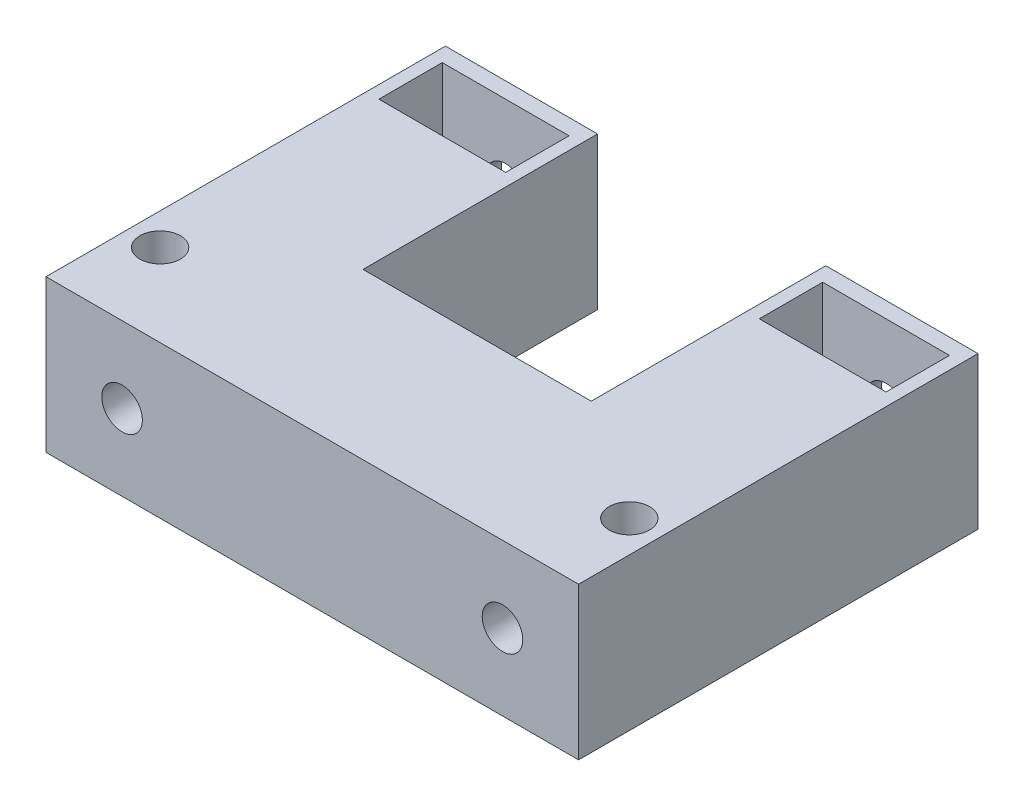
ISO-10303-21;
HEADER;
FILE_DESCRIPTION(('STEP AP214'),'2;1');
FILE_NAME('part.step','',(''),(''),'','','');
FILE_SCHEMA(('AUTOMOTIVE_DESIGN { 1 0 10303 214 1 1 1 1 }'));
ENDSEC;
DATA;
#1=APPLICATION_CONTEXT('core data for automotive mechanical design processes');
#2=APPLICATION_PROTOCOL_DEFINITION('international standard','automotive_design',2000,#1);
#3=PRODUCT_CONTEXT('',#1,'mechanical');
#4=PRODUCT('Part','Part','',(#3));
#5=PRODUCT_RELATED_PRODUCT_CATEGORY('part','',(#4));
#6=PRODUCT_DEFINITION_FORMATION('','',#4);
#7=PRODUCT_DEFINITION_CONTEXT('part definition',#1,'design');
#8=PRODUCT_DEFINITION('design','',#6,#7);
#9=PRODUCT_DEFINITION_SHAPE('','',#8);
#10=(LENGTH_UNIT() NAMED_UNIT(*) SI_UNIT(.MILLI.,.METRE.));
#11=(NAMED_UNIT(*) PLANE_ANGLE_UNIT() SI_UNIT($,.RADIAN.));
#12=(NAMED_UNIT(*) SI_UNIT($,.STERADIAN.) SOLID_ANGLE_UNIT());
#13=UNCERTAINTY_MEASURE_WITH_UNIT(LENGTH_MEASURE(1.E-05),#10,'distance_accuracy_value','');
#14=(GEOMETRIC_REPRESENTATION_CONTEXT(3) GLOBAL_UNCERTAINTY_ASSIGNED_CONTEXT((#13)) GLOBAL_UNIT_ASSIGNED_CONTEXT((#10,
#11,#12)) REPRESENTATION_CONTEXT('',''));
#15=CARTESIAN_POINT('',(0.,0.,0.));
#16=DIRECTION('',(0.,0.,1.));
#17=DIRECTION('',(1.,0.,0.));
#18=AXIS2_PLACEMENT_3D('',#15,#16,#17);
#19=CARTESIAN_POINT('',(36.,6.,17.25));
#20=DIRECTION('',(0.,0.,1.));
#21=DIRECTION('',(1.,0.,0.));
#22=AXIS2_PLACEMENT_3D('',#19,#20,#21);
#23=PLANE('',#22);
#24=DIRECTION('',(0.,1.,0.));
#25=VECTOR('',#24,1.);
#26=CARTESIAN_POINT('',(24.,6.,17.25));
#27=LINE('',#26,#25);
#28=CARTESIAN_POINT('',(24.,-6.,17.25));
#29=VERTEX_POINT('',#28);
#30=CARTESIAN_POINT('',(24.,6.,17.25));
#31=VERTEX_POINT('',#30);
#32=EDGE_CURVE('E199',#29,#31,#27,.T.);
#33=ORIENTED_EDGE('',*,*,#32,.F.);
#34=DIRECTION('',(-1.,0.,0.));
#35=VECTOR('',#34,1.);
#36=CARTESIAN_POINT('',(36.,-6.,17.25));
#37=LINE('',#36,#35);
#38=CARTESIAN_POINT('',(6.,-6.,17.25));
#39=VERTEX_POINT('',#38);
#40=EDGE_CURVE('E244',#29,#39,#37,.T.);
#41=ORIENTED_EDGE('',*,*,#40,.T.);
#42=DIRECTION('',(0.,1.,0.));
#43=VECTOR('',#42,1.);
#44=CARTESIAN_POINT('',(6.,6.,17.25));
#45=LINE('',#44,#43);
#46=CARTESIAN_POINT('',(6.,6.,17.25));
#47=VERTEX_POINT('',#46);
#48=EDGE_CURVE('E219',#39,#47,#45,.T.);
#49=ORIENTED_EDGE('',*,*,#48,.T.);
#50=DIRECTION('',(-1.,0.,0.));
#51=VECTOR('',#50,1.);
#52=CARTESIAN_POINT('',(36.,6.,17.25));
#53=LINE('',#52,#51);
#54=EDGE_CURVE('E228',#31,#47,#53,.T.);
#55=ORIENTED_EDGE('',*,*,#54,.F.);
#56=EDGE_LOOP('',(#33,#41,#49,#55));
#57=FACE_BOUND('',#56,.T.);
#58=ADVANCED_FACE('F48',(#57),#23,.F.);
#59=CARTESIAN_POINT('',(6.,-6.,-1.25));
#60=DIRECTION('',(-1.,0.,0.));
#61=DIRECTION('',(0.,0.,1.));
#62=AXIS2_PLACEMENT_3D('',#59,#60,#61);
#63=PLANE('',#62);
#64=ORIENTED_EDGE('',*,*,#48,.F.);
#65=DIRECTION('',(0.,0.,1.));
#66=VECTOR('',#65,1.);
#67=CARTESIAN_POINT('',(6.,-6.,-1.25));
#68=LINE('',#67,#66);
#69=CARTESIAN_POINT('',(6.,-6.,-1.25));
#70=VERTEX_POINT('',#69);
#71=EDGE_CURVE('E237',#70,#39,#68,.T.);
#72=ORIENTED_EDGE('',*,*,#71,.F.);
#73=DIRECTION('',(0.,-1.,0.));
#74=VECTOR('',#73,1.);
#75=CARTESIAN_POINT('',(6.,-6.,-1.25));
#76=LINE('',#75,#74);
#77=CARTESIAN_POINT('',(6.,6.,-1.25));
#78=VERTEX_POINT('',#77);
#79=EDGE_CURVE('E287',#78,#70,#76,.T.);
#80=ORIENTED_EDGE('',*,*,#79,.F.);
#81=DIRECTION('',(0.,0.,1.));
#82=VECTOR('',#81,1.);
#83=CARTESIAN_POINT('',(6.,6.,-1.25));
#84=LINE('',#83,#82);
#85=EDGE_CURVE('E299',#78,#47,#84,.T.);
#86=ORIENTED_EDGE('',*,*,#85,.T.);
#87=EDGE_LOOP('',(#64,#72,#80,#86));
#88=FACE_BOUND('',#87,.T.);
#89=ADVANCED_FACE('F345',(#88),#63,.F.);
#90=CARTESIAN_POINT('',(-5.,0.,5.));
#91=DIRECTION('',(-1.,0.,0.));
#92=DIRECTION('',(0.,0.,1.));
#93=AXIS2_PLACEMENT_3D('',#90,#91,#92);
#94=PLANE('',#93);
#95=DIRECTION('',(0.,1.,0.));
#96=VECTOR('',#95,1.);
#97=CARTESIAN_POINT('',(-5.,0.,0.));
#98=LINE('',#97,#96);
#99=CARTESIAN_POINT('',(-5.,-6.,0.));
#100=VERTEX_POINT('',#99);
#101=CARTESIAN_POINT('',(-5.,6.,0.));
#102=VERTEX_POINT('',#101);
#103=EDGE_CURVE('E318',#100,#102,#98,.T.);
#104=ORIENTED_EDGE('',*,*,#103,.T.);
#105=DIRECTION('',(0.,0.,-1.));
#106=VECTOR('',#105,1.);
#107=CARTESIAN_POINT('',(-5.,6.,5.));
#108=LINE('',#107,#106);
#109=CARTESIAN_POINT('',(-5.,6.,5.));
#110=VERTEX_POINT('',#109);
#111=EDGE_CURVE('E13',#110,#102,#108,.T.);
#112=ORIENTED_EDGE('',*,*,#111,.F.);
#113=DIRECTION('',(0.,1.,0.));
#114=VECTOR('',#113,1.);
#115=CARTESIAN_POINT('',(-5.,0.,5.));
#116=LINE('',#115,#114);
#117=CARTESIAN_POINT('',(-5.,-6.,5.));
#118=VERTEX_POINT('',#117);
#119=EDGE_CURVE('E314',#118,#110,#116,.T.);
#120=ORIENTED_EDGE('',*,*,#119,.F.);
#121=DIRECTION('',(0.,0.,-1.));
#122=VECTOR('',#121,1.);
#123=CARTESIAN_POINT('',(-5.,-6.,5.));
#124=LINE('',#123,#122);
#125=EDGE_CURVE('E317',#118,#100,#124,.T.);
#126=ORIENTED_EDGE('',*,*,#125,.T.);
#127=EDGE_LOOP('',(#104,#112,#120,#126));
#128=FACE_BOUND('',#127,.T.);
#129=ADVANCED_FACE('F50',(#128),#94,.F.);
#130=CARTESIAN_POINT('',(0.,6.,5.));
#131=DIRECTION('',(0.,-1.,0.));
#132=DIRECTION('',(1.,0.,0.));
#133=AXIS2_PLACEMENT_3D('',#130,#131,#132);
#134=PLANE('',#133);
#135=CARTESIAN_POINT('',(33.5,6.00000000000001,23.75));
#136=DIRECTION('',(0.,1.,0.));
#137=DIRECTION('',(1.,0.,0.));
#138=AXIS2_PLACEMENT_3D('',#135,#136,#137);
#139=CIRCLE('',#138,1.6);
#140=CARTESIAN_POINT('',(35.1,6.00000000000001,23.75));
#141=VERTEX_POINT('',#140);
#142=EDGE_CURVE('E411',#141,#141,#139,.T.);
#143=ORIENTED_EDGE('',*,*,#142,.F.);
#144=EDGE_LOOP('',(#143));
#145=FACE_BOUND('',#144,.T.);
#146=CARTESIAN_POINT('',(-3.5,6.,23.75));
#147=DIRECTION('',(0.,1.,0.));
#148=DIRECTION('',(-1.,0.,0.));
#149=AXIS2_PLACEMENT_3D('',#146,#147,#148);
#150=CIRCLE('',#149,1.6);
#151=CARTESIAN_POINT('',(-5.1,6.,23.75));
#152=VERTEX_POINT('',#151);
#153=EDGE_CURVE('E415',#152,#152,#150,.T.);
#154=ORIENTED_EDGE('',*,*,#153,.F.);
#155=EDGE_LOOP('',(#154));
#156=FACE_BOUND('',#155,.T.);
#157=DIRECTION('',(0.,0.,1.));
#158=VECTOR('',#157,1.);
#159=CARTESIAN_POINT('',(25.,6.,0.));
#160=LINE('',#159,#158);
#161=CARTESIAN_POINT('',(25.,6.,0.));
#162=VERTEX_POINT('',#161);
#163=CARTESIAN_POINT('',(25.,6.,5.));
#164=VERTEX_POINT('',#163);
#165=EDGE_CURVE('E193',#162,#164,#160,.T.);
#166=ORIENTED_EDGE('',*,*,#165,.F.);
#167=DIRECTION('',(-1.,0.,0.));
#168=VECTOR('',#167,1.);
#169=CARTESIAN_POINT('',(35.,6.00000000000001,0.));
#170=LINE('',#169,#168);
#171=CARTESIAN_POINT('',(35.,6.00000000000001,0.));
#172=VERTEX_POINT('',#171);
#173=EDGE_CURVE('E65',#172,#162,#170,.T.);
#174=ORIENTED_EDGE('',*,*,#173,.F.);
#175=DIRECTION('',(0.,0.,-1.));
#176=VECTOR('',#175,1.);
#177=CARTESIAN_POINT('',(35.,6.00000000000001,5.));
#178=LINE('',#177,#176);
#179=CARTESIAN_POINT('',(35.,6.00000000000001,5.));
#180=VERTEX_POINT('',#179);
#181=EDGE_CURVE('E181',#180,#172,#178,.T.);
#182=ORIENTED_EDGE('',*,*,#181,.F.);
#183=DIRECTION('',(1.,0.,0.));
#184=VECTOR('',#183,1.);
#185=CARTESIAN_POINT('',(25.,6.,5.));
#186=LINE('',#185,#184);
#187=EDGE_CURVE('E184',#164,#180,#186,.T.);
#188=ORIENTED_EDGE('',*,*,#187,.F.);
#189=EDGE_LOOP('',(#166,#174,#182,#188));
#190=FACE_BOUND('',#189,.T.);
#191=DIRECTION('',(0.,0.,-1.));
#192=VECTOR('',#191,1.);
#193=CARTESIAN_POINT('',(-6.,6.,5.));
#194=LINE('',#193,#192);
#195=CARTESIAN_POINT('',(-6.,6.,30.25));
#196=VERTEX_POINT('',#195);
#197=CARTESIAN_POINT('',(-6.,6.,-1.25));
#198=VERTEX_POINT('',#197);
#199=EDGE_CURVE('E57',#196,#198,#194,.T.);
#200=ORIENTED_EDGE('',*,*,#199,.F.);
#201=DIRECTION('',(-1.,0.,0.));
#202=VECTOR('',#201,1.);
#203=CARTESIAN_POINT('',(6.,6.,30.25));
#204=LINE('',#203,#202);
#205=CARTESIAN_POINT('',(36.,6.,30.25));
#206=VERTEX_POINT('',#205);
#207=EDGE_CURVE('E258',#206,#196,#204,.T.);
#208=ORIENTED_EDGE('',*,*,#207,.F.);
#209=DIRECTION('',(0.,0.,1.));
#210=VECTOR('',#209,1.);
#211=CARTESIAN_POINT('',(36.,6.,30.25));
#212=LINE('',#211,#210);
#213=CARTESIAN_POINT('',(36.,6.,-1.25));
#214=VERTEX_POINT('',#213);
#215=EDGE_CURVE('E225',#214,#206,#212,.T.);
#216=ORIENTED_EDGE('',*,*,#215,.F.);
#217=DIRECTION('',(1.,0.,0.));
#218=VECTOR('',#217,1.);
#219=CARTESIAN_POINT('',(36.,6.,-1.25));
#220=LINE('',#219,#218);
#221=CARTESIAN_POINT('',(24.,6.,-1.25));
#222=VERTEX_POINT('',#221);
#223=EDGE_CURVE('E210',#222,#214,#220,.T.);
#224=ORIENTED_EDGE('',*,*,#223,.F.);
#225=DIRECTION('',(0.,0.,1.));
#226=VECTOR('',#225,1.);
#227=CARTESIAN_POINT('',(24.,6.,-1.25));
#228=LINE('',#227,#226);
#229=EDGE_CURVE('E213',#222,#31,#228,.T.);
#230=ORIENTED_EDGE('',*,*,#229,.T.);
#231=ORIENTED_EDGE('',*,*,#54,.T.);
#232=ORIENTED_EDGE('',*,*,#85,.F.);
#233=DIRECTION('',(1.,0.,0.));
#234=VECTOR('',#233,1.);
#235=CARTESIAN_POINT('',(-6.,6.,-1.25));
#236=LINE('',#235,#234);
#237=EDGE_CURVE('E297',#198,#78,#236,.T.);
#238=ORIENTED_EDGE('',*,*,#237,.F.);
#239=EDGE_LOOP('',(#200,#208,#216,#224,#230,#231,#232,#238));
#240=FACE_BOUND('',#239,.T.);
#241=ORIENTED_EDGE('',*,*,#111,.T.);
#242=DIRECTION('',(1.,0.,0.));
#243=VECTOR('',#242,1.);
#244=CARTESIAN_POINT('',(-6.,6.,0.));
#245=LINE('',#244,#243);
#246=CARTESIAN_POINT('',(5.,6.,0.));
#247=VERTEX_POINT('',#246);
#248=EDGE_CURVE('E291',#102,#247,#245,.T.);
#249=ORIENTED_EDGE('',*,*,#248,.T.);
#250=DIRECTION('',(0.,0.,-1.));
#251=VECTOR('',#250,1.);
#252=CARTESIAN_POINT('',(5.,6.,5.));
#253=LINE('',#252,#251);
#254=CARTESIAN_POINT('',(5.,6.,5.));
#255=VERTEX_POINT('',#254);
#256=EDGE_CURVE('E280',#255,#247,#253,.T.);
#257=ORIENTED_EDGE('',*,*,#256,.F.);
#258=DIRECTION('',(-1.,0.,0.));
#259=VECTOR('',#258,1.);
#260=CARTESIAN_POINT('',(6.,6.,5.));
#261=LINE('',#260,#259);
#262=EDGE_CURVE('E274',#255,#110,#261,.T.);
#263=ORIENTED_EDGE('',*,*,#262,.T.);
#264=EDGE_LOOP('',(#241,#249,#257,#263));
#265=FACE_BOUND('',#264,.T.);
#266=ADVANCED_FACE('F339',(#145,#156,#190,#240,#265),#134,.F.);
#267=CARTESIAN_POINT('',(-6.,0.,5.));
#268=DIRECTION('',(-1.,0.,0.));
#269=DIRECTION('',(0.,0.,1.));
#270=AXIS2_PLACEMENT_3D('',#267,#268,#269);
#271=PLANE('',#270);
#272=ORIENTED_EDGE('',*,*,#199,.T.);
#273=DIRECTION('',(0.,1.,0.));
#274=VECTOR('',#273,1.);
#275=CARTESIAN_POINT('',(-6.,-6.,-1.25));
#276=LINE('',#275,#274);
#277=CARTESIAN_POINT('',(-6.,-6.,-1.25));
#278=VERTEX_POINT('',#277);
#279=EDGE_CURVE('E294',#278,#198,#276,.T.);
#280=ORIENTED_EDGE('',*,*,#279,.F.);
#281=DIRECTION('',(0.,0.,-1.));
#282=VECTOR('',#281,1.);
#283=CARTESIAN_POINT('',(-6.,-6.,5.));
#284=LINE('',#283,#282);
#285=CARTESIAN_POINT('',(-6.,-6.,30.25));
#286=VERTEX_POINT('',#285);
#287=EDGE_CURVE('E321',#286,#278,#284,.T.);
#288=ORIENTED_EDGE('',*,*,#287,.F.);
#289=DIRECTION('',(0.,-1.,0.));
#290=VECTOR('',#289,1.);
#291=CARTESIAN_POINT('',(-6.,-6.,30.25));
#292=LINE('',#291,#290);
#293=EDGE_CURVE('E250',#196,#286,#292,.T.);
#294=ORIENTED_EDGE('',*,*,#293,.F.);
#295=EDGE_LOOP('',(#272,#280,#288,#294));
#296=FACE_BOUND('',#295,.T.);
#297=ADVANCED_FACE('F333',(#296),#271,.T.);
#298=CARTESIAN_POINT('',(0.,-6.,5.));
#299=DIRECTION('',(0.,-1.,0.));
#300=DIRECTION('',(1.,0.,0.));
#301=AXIS2_PLACEMENT_3D('',#298,#299,#300);
#302=PLANE('',#301);
#303=CARTESIAN_POINT('',(33.5,-5.99999999999999,23.75));
#304=DIRECTION('',(0.,1.,0.));
#305=DIRECTION('',(1.,0.,0.));
#306=AXIS2_PLACEMENT_3D('',#303,#304,#305);
#307=CIRCLE('',#306,1.6);
#308=CARTESIAN_POINT('',(35.1,-5.99999999999999,23.75));
#309=VERTEX_POINT('',#308);
#310=EDGE_CURVE('E614',#309,#309,#307,.T.);
#311=ORIENTED_EDGE('',*,*,#310,.T.);
#312=EDGE_LOOP('',(#311));
#313=FACE_BOUND('',#312,.T.);
#314=CARTESIAN_POINT('',(-3.5,-6.,23.75));
#315=DIRECTION('',(0.,1.,0.));
#316=DIRECTION('',(-1.,0.,0.));
#317=AXIS2_PLACEMENT_3D('',#314,#315,#316);
#318=CIRCLE('',#317,1.6);
#319=CARTESIAN_POINT('',(-5.1,-6.,23.75));
#320=VERTEX_POINT('',#319);
#321=EDGE_CURVE('E618',#320,#320,#318,.T.);
#322=ORIENTED_EDGE('',*,*,#321,.T.);
#323=EDGE_LOOP('',(#322));
#324=FACE_BOUND('',#323,.T.);
#325=DIRECTION('',(-1.,0.,0.));
#326=VECTOR('',#325,1.);
#327=CARTESIAN_POINT('',(35.,-5.99999999999999,0.));
#328=LINE('',#327,#326);
#329=CARTESIAN_POINT('',(35.,-5.99999999999999,0.));
#330=VERTEX_POINT('',#329);
#331=CARTESIAN_POINT('',(25.,-6.,0.));
#332=VERTEX_POINT('',#331);
#333=EDGE_CURVE('E165',#330,#332,#328,.T.);
#334=ORIENTED_EDGE('',*,*,#333,.T.);
#335=DIRECTION('',(0.,0.,1.));
#336=VECTOR('',#335,1.);
#337=CARTESIAN_POINT('',(25.,-6.,0.));
#338=LINE('',#337,#336);
#339=CARTESIAN_POINT('',(25.,-5.99999999999999,5.));
#340=VERTEX_POINT('',#339);
#341=EDGE_CURVE('E174',#332,#340,#338,.T.);
#342=ORIENTED_EDGE('',*,*,#341,.T.);
#343=DIRECTION('',(1.,0.,0.));
#344=VECTOR('',#343,1.);
#345=CARTESIAN_POINT('',(25.,-6.,5.));
#346=LINE('',#345,#344);
#347=CARTESIAN_POINT('',(35.,-5.99999999999999,5.));
#348=VERTEX_POINT('',#347);
#349=EDGE_CURVE('E73',#340,#348,#346,.T.);
#350=ORIENTED_EDGE('',*,*,#349,.T.);
#351=DIRECTION('',(0.,0.,-1.));
#352=VECTOR('',#351,1.);
#353=CARTESIAN_POINT('',(35.,-5.99999999999999,5.));
#354=LINE('',#353,#352);
#355=EDGE_CURVE('E171',#348,#330,#354,.T.);
#356=ORIENTED_EDGE('',*,*,#355,.T.);
#357=EDGE_LOOP('',(#334,#342,#350,#356));
#358=FACE_BOUND('',#357,.T.);
#359=ORIENTED_EDGE('',*,*,#71,.T.);
#360=ORIENTED_EDGE('',*,*,#40,.F.);
#361=DIRECTION('',(0.,0.,1.));
#362=VECTOR('',#361,1.);
#363=CARTESIAN_POINT('',(24.,-6.,-1.25));
#364=LINE('',#363,#362);
#365=CARTESIAN_POINT('',(24.,-6.,-1.25));
#366=VERTEX_POINT('',#365);
#367=EDGE_CURVE('E217',#366,#29,#364,.T.);
#368=ORIENTED_EDGE('',*,*,#367,.F.);
#369=DIRECTION('',(-1.,0.,0.));
#370=VECTOR('',#369,1.);
#371=CARTESIAN_POINT('',(36.,-6.,-1.25));
#372=LINE('',#371,#370);
#373=CARTESIAN_POINT('',(36.,-6.,-1.25));
#374=VERTEX_POINT('',#373);
#375=EDGE_CURVE('E206',#374,#366,#372,.T.);
#376=ORIENTED_EDGE('',*,*,#375,.F.);
#377=DIRECTION('',(0.,0.,-1.));
#378=VECTOR('',#377,1.);
#379=CARTESIAN_POINT('',(36.,-6.,30.25));
#380=LINE('',#379,#378);
#381=CARTESIAN_POINT('',(36.,-6.,30.25));
#382=VERTEX_POINT('',#381);
#383=EDGE_CURVE('E223',#382,#374,#380,.T.);
#384=ORIENTED_EDGE('',*,*,#383,.F.);
#385=DIRECTION('',(1.,0.,0.));
#386=VECTOR('',#385,1.);
#387=CARTESIAN_POINT('',(6.,-6.,30.25));
#388=LINE('',#387,#386);
#389=EDGE_CURVE('E254',#286,#382,#388,.T.);
#390=ORIENTED_EDGE('',*,*,#389,.F.);
#391=ORIENTED_EDGE('',*,*,#287,.T.);
#392=DIRECTION('',(-1.,0.,0.));
#393=VECTOR('',#392,1.);
#394=CARTESIAN_POINT('',(-6.,-6.,-1.25));
#395=LINE('',#394,#393);
#396=EDGE_CURVE('E290',#70,#278,#395,.T.);
#397=ORIENTED_EDGE('',*,*,#396,.F.);
#398=EDGE_LOOP('',(#359,#360,#368,#376,#384,#390,#391,#397));
#399=FACE_BOUND('',#398,.T.);
#400=ORIENTED_EDGE('',*,*,#125,.F.);
#401=DIRECTION('',(1.,0.,0.));
#402=VECTOR('',#401,1.);
#403=CARTESIAN_POINT('',(6.,-6.,5.));
#404=LINE('',#403,#402);
#405=CARTESIAN_POINT('',(5.,-6.,5.));
#406=VERTEX_POINT('',#405);
#407=EDGE_CURVE('E271',#118,#406,#404,.T.);
#408=ORIENTED_EDGE('',*,*,#407,.T.);
#409=DIRECTION('',(0.,0.,-1.));
#410=VECTOR('',#409,1.);
#411=CARTESIAN_POINT('',(5.,-6.,5.));
#412=LINE('',#411,#410);
#413=CARTESIAN_POINT('',(5.,-6.,0.));
#414=VERTEX_POINT('',#413);
#415=EDGE_CURVE('E284',#406,#414,#412,.T.);
#416=ORIENTED_EDGE('',*,*,#415,.T.);
#417=DIRECTION('',(-1.,0.,0.));
#418=VECTOR('',#417,1.);
#419=CARTESIAN_POINT('',(-6.,-6.,0.));
#420=LINE('',#419,#418);
#421=EDGE_CURVE('E286',#414,#100,#420,.T.);
#422=ORIENTED_EDGE('',*,*,#421,.T.);
#423=EDGE_LOOP('',(#400,#408,#416,#422));
#424=FACE_BOUND('',#423,.T.);
#425=ADVANCED_FACE('F178',(#313,#324,#358,#399,#424),#302,.T.);
#426=CARTESIAN_POINT('',(0.,0.,-1.25));
#427=DIRECTION('',(0.,0.,-1.));
#428=DIRECTION('',(-1.,0.,0.));
#429=AXIS2_PLACEMENT_3D('',#426,#427,#428);
#430=PLANE('',#429);
#431=CARTESIAN_POINT('',(0.,0.,-1.25));
#432=DIRECTION('',(0.,0.,1.));
#433=DIRECTION('',(1.,0.,0.));
#434=AXIS2_PLACEMENT_3D('',#431,#432,#433);
#435=CIRCLE('',#434,1.6);
#436=CARTESIAN_POINT('',(1.6,0.,-1.25));
#437=VERTEX_POINT('',#436);
#438=EDGE_CURVE('E263',#437,#437,#435,.T.);
#439=ORIENTED_EDGE('',*,*,#438,.T.);
#440=EDGE_LOOP('',(#439));
#441=FACE_BOUND('',#440,.T.);
#442=ORIENTED_EDGE('',*,*,#79,.T.);
#443=ORIENTED_EDGE('',*,*,#396,.T.);
#444=ORIENTED_EDGE('',*,*,#279,.T.);
#445=ORIENTED_EDGE('',*,*,#237,.T.);
#446=EDGE_LOOP('',(#442,#443,#444,#445));
#447=FACE_BOUND('',#446,.T.);
#448=ADVANCED_FACE('F337',(#441,#447),#430,.T.);
#449=CARTESIAN_POINT('',(0.,0.,0.));
#450=DIRECTION('',(0.,0.,-1.));
#451=DIRECTION('',(-1.,0.,0.));
#452=AXIS2_PLACEMENT_3D('',#449,#450,#451);
#453=PLANE('',#452);
#454=CARTESIAN_POINT('',(0.,0.,0.));
#455=DIRECTION('',(0.,0.,1.));
#456=DIRECTION('',(1.,0.,0.));
#457=AXIS2_PLACEMENT_3D('',#454,#455,#456);
#458=CIRCLE('',#457,1.6);
#459=CARTESIAN_POINT('',(1.6,0.,0.));
#460=VERTEX_POINT('',#459);
#461=EDGE_CURVE('E262',#460,#460,#458,.T.);
#462=ORIENTED_EDGE('',*,*,#461,.F.);
#463=EDGE_LOOP('',(#462));
#464=FACE_BOUND('',#463,.T.);
#465=ORIENTED_EDGE('',*,*,#421,.F.);
#466=DIRECTION('',(0.,1.,0.));
#467=VECTOR('',#466,1.);
#468=CARTESIAN_POINT('',(5.,0.,0.));
#469=LINE('',#468,#467);
#470=EDGE_CURVE('E277',#414,#247,#469,.T.);
#471=ORIENTED_EDGE('',*,*,#470,.T.);
#472=ORIENTED_EDGE('',*,*,#248,.F.);
#473=ORIENTED_EDGE('',*,*,#103,.F.);
#474=EDGE_LOOP('',(#465,#471,#472,#473));
#475=FACE_BOUND('',#474,.T.);
#476=ADVANCED_FACE('F391',(#464,#475),#453,.F.);
#477=CARTESIAN_POINT('',(5.,0.,5.));
#478=DIRECTION('',(-1.,0.,0.));
#479=DIRECTION('',(0.,0.,1.));
#480=AXIS2_PLACEMENT_3D('',#477,#478,#479);
#481=PLANE('',#480);
#482=ORIENTED_EDGE('',*,*,#470,.F.);
#483=ORIENTED_EDGE('',*,*,#415,.F.);
#484=DIRECTION('',(0.,1.,0.));
#485=VECTOR('',#484,1.);
#486=CARTESIAN_POINT('',(5.,0.,5.));
#487=LINE('',#486,#485);
#488=EDGE_CURVE('E278',#406,#255,#487,.T.);
#489=ORIENTED_EDGE('',*,*,#488,.T.);
#490=ORIENTED_EDGE('',*,*,#256,.T.);
#491=EDGE_LOOP('',(#482,#483,#489,#490));
#492=FACE_BOUND('',#491,.T.);
#493=ADVANCED_FACE('F387',(#492),#481,.T.);
#494=CARTESIAN_POINT('',(0.,0.,5.));
#495=DIRECTION('',(0.,0.,1.));
#496=DIRECTION('',(1.,0.,0.));
#497=AXIS2_PLACEMENT_3D('',#494,#495,#496);
#498=PLANE('',#497);
#499=CARTESIAN_POINT('',(0.,0.,5.));
#500=DIRECTION('',(0.,0.,1.));
#501=DIRECTION('',(1.,0.,0.));
#502=AXIS2_PLACEMENT_3D('',#499,#500,#501);
#503=CIRCLE('',#502,1.6);
#504=CARTESIAN_POINT('',(1.6,0.,5.));
#505=VERTEX_POINT('',#504);
#506=EDGE_CURVE('E266',#505,#505,#503,.T.);
#507=ORIENTED_EDGE('',*,*,#506,.T.);
#508=EDGE_LOOP('',(#507));
#509=FACE_BOUND('',#508,.T.);
#510=ORIENTED_EDGE('',*,*,#407,.F.);
#511=ORIENTED_EDGE('',*,*,#119,.T.);
#512=ORIENTED_EDGE('',*,*,#262,.F.);
#513=ORIENTED_EDGE('',*,*,#488,.F.);
#514=EDGE_LOOP('',(#510,#511,#512,#513));
#515=FACE_BOUND('',#514,.T.);
#516=ADVANCED_FACE('F383',(#509,#515),#498,.F.);
#517=CARTESIAN_POINT('',(0.,0.,5.));
#518=DIRECTION('',(0.,0.,1.));
#519=DIRECTION('',(1.,0.,0.));
#520=AXIS2_PLACEMENT_3D('',#517,#518,#519);
#521=CYLINDRICAL_SURFACE('',#520,1.6);
#522=ORIENTED_EDGE('',*,*,#506,.F.);
#523=EDGE_LOOP('',(#522));
#524=FACE_BOUND('',#523,.T.);
#525=CARTESIAN_POINT('',(0.,0.,30.25));
#526=DIRECTION('',(0.,0.,1.));
#527=DIRECTION('',(1.,0.,0.));
#528=AXIS2_PLACEMENT_3D('',#525,#526,#527);
#529=CIRCLE('',#528,1.6);
#530=CARTESIAN_POINT('',(1.6,0.,30.25));
#531=VERTEX_POINT('',#530);
#532=EDGE_CURVE('E231',#531,#531,#529,.T.);
#533=ORIENTED_EDGE('',*,*,#532,.T.);
#534=EDGE_LOOP('',(#533));
#535=FACE_BOUND('',#534,.T.);
#536=ADVANCED_FACE('F379',(#524,#535),#521,.F.);
#537=CARTESIAN_POINT('',(0.,0.,-1.25));
#538=DIRECTION('',(0.,0.,1.));
#539=DIRECTION('',(1.,0.,0.));
#540=AXIS2_PLACEMENT_3D('',#537,#538,#539);
#541=CYLINDRICAL_SURFACE('',#540,1.6);
#542=ORIENTED_EDGE('',*,*,#438,.F.);
#543=EDGE_LOOP('',(#542));
#544=FACE_BOUND('',#543,.T.);
#545=ORIENTED_EDGE('',*,*,#461,.T.);
#546=EDGE_LOOP('',(#545));
#547=FACE_BOUND('',#546,.T.);
#548=ADVANCED_FACE('F375',(#544,#547),#541,.F.);
#549=CARTESIAN_POINT('',(0.,0.,30.25));
#550=DIRECTION('',(0.,0.,1.));
#551=DIRECTION('',(1.,0.,0.));
#552=AXIS2_PLACEMENT_3D('',#549,#550,#551);
#553=PLANE('',#552);
#554=CARTESIAN_POINT('',(30.,0.,30.25));
#555=DIRECTION('',(0.,0.,1.));
#556=DIRECTION('',(-1.,0.,0.));
#557=AXIS2_PLACEMENT_3D('',#554,#555,#556);
#558=CIRCLE('',#557,1.59999999999999);
#559=CARTESIAN_POINT('',(28.4,0.,30.25));
#560=VERTEX_POINT('',#559);
#561=EDGE_CURVE('E621',#560,#560,#558,.T.);
#562=ORIENTED_EDGE('',*,*,#561,.F.);
#563=EDGE_LOOP('',(#562));
#564=FACE_BOUND('',#563,.T.);
#565=ORIENTED_EDGE('',*,*,#293,.T.);
#566=ORIENTED_EDGE('',*,*,#389,.T.);
#567=DIRECTION('',(0.,-1.,0.));
#568=VECTOR('',#567,1.);
#569=CARTESIAN_POINT('',(36.,6.,30.25));
#570=LINE('',#569,#568);
#571=EDGE_CURVE('E220',#206,#382,#570,.T.);
#572=ORIENTED_EDGE('',*,*,#571,.F.);
#573=ORIENTED_EDGE('',*,*,#207,.T.);
#574=EDGE_LOOP('',(#565,#566,#572,#573));
#575=FACE_BOUND('',#574,.T.);
#576=ORIENTED_EDGE('',*,*,#532,.F.);
#577=EDGE_LOOP('',(#576));
#578=FACE_BOUND('',#577,.T.);
#579=ADVANCED_FACE('F362',(#564,#575,#578),#553,.T.);
#580=CARTESIAN_POINT('',(36.,0.,0.));
#581=DIRECTION('',(1.,0.,0.));
#582=DIRECTION('',(0.,0.,-1.));
#583=AXIS2_PLACEMENT_3D('',#580,#581,#582);
#584=PLANE('',#583);
#585=ORIENTED_EDGE('',*,*,#571,.T.);
#586=ORIENTED_EDGE('',*,*,#383,.T.);
#587=DIRECTION('',(0.,-1.,0.));
#588=VECTOR('',#587,1.);
#589=CARTESIAN_POINT('',(36.,6.,-1.25));
#590=LINE('',#589,#588);
#591=EDGE_CURVE('E203',#214,#374,#590,.T.);
#592=ORIENTED_EDGE('',*,*,#591,.F.);
#593=ORIENTED_EDGE('',*,*,#215,.T.);
#594=EDGE_LOOP('',(#585,#586,#592,#593));
#595=FACE_BOUND('',#594,.T.);
#596=ADVANCED_FACE('F360',(#595),#584,.T.);
#597=CARTESIAN_POINT('',(24.,6.,-1.25));
#598=DIRECTION('',(1.,0.,0.));
#599=DIRECTION('',(0.,1.,0.));
#600=AXIS2_PLACEMENT_3D('',#597,#598,#599);
#601=PLANE('',#600);
#602=ORIENTED_EDGE('',*,*,#32,.T.);
#603=ORIENTED_EDGE('',*,*,#229,.F.);
#604=DIRECTION('',(0.,1.,0.));
#605=VECTOR('',#604,1.);
#606=CARTESIAN_POINT('',(24.,6.,-1.25));
#607=LINE('',#606,#605);
#608=EDGE_CURVE('E208',#366,#222,#607,.T.);
#609=ORIENTED_EDGE('',*,*,#608,.F.);
#610=ORIENTED_EDGE('',*,*,#367,.T.);
#611=EDGE_LOOP('',(#602,#603,#609,#610));
#612=FACE_BOUND('',#611,.T.);
#613=ADVANCED_FACE('F354',(#612),#601,.F.);
#614=CARTESIAN_POINT('',(0.,0.,-1.25));
#615=DIRECTION('',(0.,0.,-1.));
#616=DIRECTION('',(-1.,0.,0.));
#617=AXIS2_PLACEMENT_3D('',#614,#615,#616);
#618=PLANE('',#617);
#619=CARTESIAN_POINT('',(30.,0.,-1.25));
#620=DIRECTION('',(0.,0.,-1.));
#621=DIRECTION('',(-1.,0.,0.));
#622=AXIS2_PLACEMENT_3D('',#619,#620,#621);
#623=CIRCLE('',#622,1.59999999999999);
#624=CARTESIAN_POINT('',(28.4,0.,-1.25));
#625=VERTEX_POINT('',#624);
#626=EDGE_CURVE('E187',#625,#625,#623,.T.);
#627=ORIENTED_EDGE('',*,*,#626,.F.);
#628=EDGE_LOOP('',(#627));
#629=FACE_BOUND('',#628,.T.);
#630=ORIENTED_EDGE('',*,*,#591,.T.);
#631=ORIENTED_EDGE('',*,*,#375,.T.);
#632=ORIENTED_EDGE('',*,*,#608,.T.);
#633=ORIENTED_EDGE('',*,*,#223,.T.);
#634=EDGE_LOOP('',(#630,#631,#632,#633));
#635=FACE_BOUND('',#634,.T.);
#636=ADVANCED_FACE('F357',(#629,#635),#618,.T.);
#637=CARTESIAN_POINT('',(35.,-5.99999999999999,0.));
#638=DIRECTION('',(0.,0.,-1.));
#639=DIRECTION('',(-1.,0.,0.));
#640=AXIS2_PLACEMENT_3D('',#637,#638,#639);
#641=PLANE('',#640);
#642=CARTESIAN_POINT('',(30.,0.,0.));
#643=DIRECTION('',(0.,0.,-1.));
#644=DIRECTION('',(-1.,0.,0.));
#645=AXIS2_PLACEMENT_3D('',#642,#643,#644);
#646=CIRCLE('',#645,1.59999999999999);
#647=CARTESIAN_POINT('',(28.4,0.,0.));
#648=VERTEX_POINT('',#647);
#649=EDGE_CURVE('E624',#648,#648,#646,.T.);
#650=ORIENTED_EDGE('',*,*,#649,.T.);
#651=EDGE_LOOP('',(#650));
#652=FACE_BOUND('',#651,.T.);
#653=ORIENTED_EDGE('',*,*,#173,.T.);
#654=DIRECTION('',(0.,1.,0.));
#655=VECTOR('',#654,1.);
#656=CARTESIAN_POINT('',(25.,-6.,0.));
#657=LINE('',#656,#655);
#658=EDGE_CURVE('E161',#332,#162,#657,.T.);
#659=ORIENTED_EDGE('',*,*,#658,.F.);
#660=ORIENTED_EDGE('',*,*,#333,.F.);
#661=DIRECTION('',(0.,1.,0.));
#662=VECTOR('',#661,1.);
#663=CARTESIAN_POINT('',(35.,-5.99999999999999,0.));
#664=LINE('',#663,#662);
#665=EDGE_CURVE('E197',#330,#172,#664,.T.);
#666=ORIENTED_EDGE('',*,*,#665,.T.);
#667=EDGE_LOOP('',(#653,#659,#660,#666));
#668=FACE_BOUND('',#667,.T.);
#669=ADVANCED_FACE('F163',(#652,#668),#641,.F.);
#670=CARTESIAN_POINT('',(35.,-5.99999999999999,5.));
#671=DIRECTION('',(1.,0.,0.));
#672=DIRECTION('',(0.,1.,0.));
#673=AXIS2_PLACEMENT_3D('',#670,#671,#672);
#674=PLANE('',#673);
#675=ORIENTED_EDGE('',*,*,#181,.T.);
#676=ORIENTED_EDGE('',*,*,#665,.F.);
#677=ORIENTED_EDGE('',*,*,#355,.F.);
#678=DIRECTION('',(0.,1.,0.));
#679=VECTOR('',#678,1.);
#680=CARTESIAN_POINT('',(35.,-5.99999999999999,5.));
#681=LINE('',#680,#679);
#682=EDGE_CURVE('E200',#348,#180,#681,.T.);
#683=ORIENTED_EDGE('',*,*,#682,.T.);
#684=EDGE_LOOP('',(#675,#676,#677,#683));
#685=FACE_BOUND('',#684,.T.);
#686=ADVANCED_FACE('F420',(#685),#674,.F.);
#687=CARTESIAN_POINT('',(25.,-6.,5.));
#688=DIRECTION('',(0.,0.,1.));
#689=DIRECTION('',(1.,0.,0.));
#690=AXIS2_PLACEMENT_3D('',#687,#688,#689);
#691=PLANE('',#690);
#692=CARTESIAN_POINT('',(30.,0.,5.));
#693=DIRECTION('',(0.,0.,1.));
#694=DIRECTION('',(1.,0.,0.));
#695=AXIS2_PLACEMENT_3D('',#692,#693,#694);
#696=CIRCLE('',#695,1.59999999999999);
#697=CARTESIAN_POINT('',(31.6,0.,5.));
#698=VERTEX_POINT('',#697);
#699=EDGE_CURVE('E52',#698,#698,#696,.T.);
#700=ORIENTED_EDGE('',*,*,#699,.T.);
#701=EDGE_LOOP('',(#700));
#702=FACE_BOUND('',#701,.T.);
#703=ORIENTED_EDGE('',*,*,#187,.T.);
#704=ORIENTED_EDGE('',*,*,#682,.F.);
#705=ORIENTED_EDGE('',*,*,#349,.F.);
#706=DIRECTION('',(0.,1.,0.));
#707=VECTOR('',#706,1.);
#708=CARTESIAN_POINT('',(25.,-6.,5.));
#709=LINE('',#708,#707);
#710=EDGE_CURVE('E170',#340,#164,#709,.T.);
#711=ORIENTED_EDGE('',*,*,#710,.T.);
#712=EDGE_LOOP('',(#703,#704,#705,#711));
#713=FACE_BOUND('',#712,.T.);
#714=ADVANCED_FACE('F418',(#702,#713),#691,.F.);
#715=CARTESIAN_POINT('',(25.,-6.,0.));
#716=DIRECTION('',(-1.,0.,0.));
#717=DIRECTION('',(0.,-1.,0.));
#718=AXIS2_PLACEMENT_3D('',#715,#716,#717);
#719=PLANE('',#718);
#720=ORIENTED_EDGE('',*,*,#165,.T.);
#721=ORIENTED_EDGE('',*,*,#710,.F.);
#722=ORIENTED_EDGE('',*,*,#341,.F.);
#723=ORIENTED_EDGE('',*,*,#658,.T.);
#724=EDGE_LOOP('',(#720,#721,#722,#723));
#725=FACE_BOUND('',#724,.T.);
#726=ADVANCED_FACE('F175',(#725),#719,.F.);
#727=CARTESIAN_POINT('',(30.,0.,-1.75));
#728=DIRECTION('',(0.,0.,1.));
#729=DIRECTION('',(1.,0.,0.));
#730=AXIS2_PLACEMENT_3D('',#727,#728,#729);
#731=CYLINDRICAL_SURFACE('',#730,1.59999999999999);
#732=ORIENTED_EDGE('',*,*,#561,.T.);
#733=EDGE_LOOP('',(#732));
#734=FACE_BOUND('',#733,.T.);
#735=ORIENTED_EDGE('',*,*,#699,.F.);
#736=EDGE_LOOP('',(#735));
#737=FACE_BOUND('',#736,.T.);
#738=ADVANCED_FACE('F436',(#734,#737),#731,.F.);
#739=ORIENTED_EDGE('',*,*,#626,.T.);
#740=EDGE_LOOP('',(#739));
#741=FACE_BOUND('',#740,.T.);
#742=ORIENTED_EDGE('',*,*,#649,.F.);
#743=EDGE_LOOP('',(#742));
#744=FACE_BOUND('',#743,.T.);
#745=ADVANCED_FACE('F432',(#741,#744),#731,.F.);
#746=CARTESIAN_POINT('',(-3.5,-6.,23.75));
#747=DIRECTION('',(0.,1.,0.));
#748=DIRECTION('',(-1.,0.,0.));
#749=AXIS2_PLACEMENT_3D('',#746,#747,#748);
#750=CYLINDRICAL_SURFACE('',#749,1.6);
#751=ORIENTED_EDGE('',*,*,#321,.F.);
#752=EDGE_LOOP('',(#751));
#753=FACE_BOUND('',#752,.T.);
#754=ORIENTED_EDGE('',*,*,#153,.T.);
#755=EDGE_LOOP('',(#754));
#756=FACE_BOUND('',#755,.T.);
#757=ADVANCED_FACE('F588',(#753,#756),#750,.F.);
#758=CARTESIAN_POINT('',(33.5,-5.99999999999999,23.75));
#759=DIRECTION('',(0.,1.,0.));
#760=DIRECTION('',(-1.,0.,0.));
#761=AXIS2_PLACEMENT_3D('',#758,#759,#760);
#762=CYLINDRICAL_SURFACE('',#761,1.6);
#763=ORIENTED_EDGE('',*,*,#310,.F.);
#764=EDGE_LOOP('',(#763));
#765=FACE_BOUND('',#764,.T.);
#766=ORIENTED_EDGE('',*,*,#142,.T.);
#767=EDGE_LOOP('',(#766));
#768=FACE_BOUND('',#767,.T.);
#769=ADVANCED_FACE('F595',(#765,#768),#762,.F.);
#770=CLOSED_SHELL('',(#58,#89,#129,#266,#297,#425,#448,#476,#493,#516,#536,#548,#579,#596,#613,
#636,#669,#686,#714,#726,#738,#745,#757,#769));
#771=MANIFOLD_SOLID_BREP('B2',#770);
#772=ADVANCED_BREP_SHAPE_REPRESENTATION('',(#18,#771),#14);
#773=SHAPE_DEFINITION_REPRESENTATION(#9,#772);
ENDSEC;
END-ISO-10303-21;
